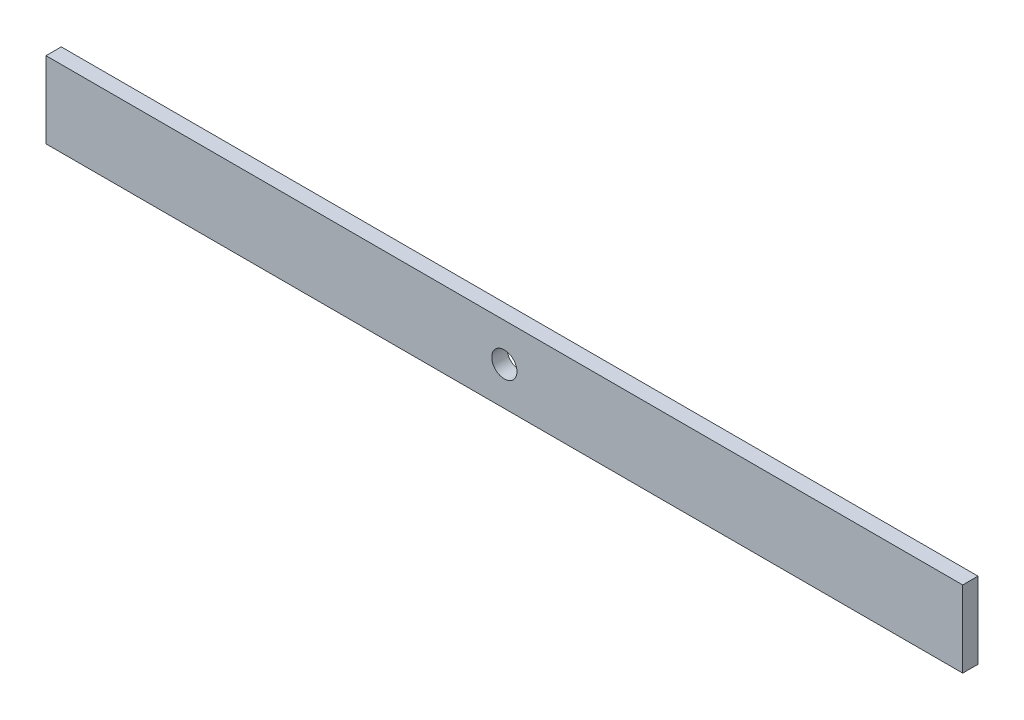
ISO-10303-21;
HEADER;
FILE_DESCRIPTION(('STEP AP214'),'2;1');
FILE_NAME('part.step','',(''),(''),'','','');
FILE_SCHEMA(('AUTOMOTIVE_DESIGN { 1 0 10303 214 1 1 1 1 }'));
ENDSEC;
DATA;
#1=APPLICATION_CONTEXT('core data for automotive mechanical design processes');
#2=APPLICATION_PROTOCOL_DEFINITION('international standard','automotive_design',2000,#1);
#3=PRODUCT_CONTEXT('',#1,'mechanical');
#4=PRODUCT('Part','Part','',(#3));
#5=PRODUCT_RELATED_PRODUCT_CATEGORY('part','',(#4));
#6=PRODUCT_DEFINITION_FORMATION('','',#4);
#7=PRODUCT_DEFINITION_CONTEXT('part definition',#1,'design');
#8=PRODUCT_DEFINITION('design','',#6,#7);
#9=PRODUCT_DEFINITION_SHAPE('','',#8);
#10=(LENGTH_UNIT() NAMED_UNIT(*) SI_UNIT(.MILLI.,.METRE.));
#11=(NAMED_UNIT(*) PLANE_ANGLE_UNIT() SI_UNIT($,.RADIAN.));
#12=(NAMED_UNIT(*) SI_UNIT($,.STERADIAN.) SOLID_ANGLE_UNIT());
#13=UNCERTAINTY_MEASURE_WITH_UNIT(LENGTH_MEASURE(1.E-05),#10,'distance_accuracy_value','');
#14=(GEOMETRIC_REPRESENTATION_CONTEXT(3) GLOBAL_UNCERTAINTY_ASSIGNED_CONTEXT((#13)) GLOBAL_UNIT_ASSIGNED_CONTEXT((#10,
#11,#12)) REPRESENTATION_CONTEXT('',''));
#15=CARTESIAN_POINT('',(0.,0.,0.));
#16=DIRECTION('',(0.,0.,1.));
#17=DIRECTION('',(1.,0.,0.));
#18=AXIS2_PLACEMENT_3D('',#15,#16,#17);
#19=CARTESIAN_POINT('',(60.,5.,-2.));
#20=DIRECTION('',(1.,0.,0.));
#21=DIRECTION('',(0.,0.,-1.));
#22=AXIS2_PLACEMENT_3D('',#19,#20,#21);
#23=PLANE('',#22);
#24=DIRECTION('',(0.,1.,0.));
#25=VECTOR('',#24,1.);
#26=CARTESIAN_POINT('',(60.,5.,0.));
#27=LINE('',#26,#25);
#28=CARTESIAN_POINT('',(60.,-5.,0.));
#29=VERTEX_POINT('',#28);
#30=CARTESIAN_POINT('',(60.,5.,0.));
#31=VERTEX_POINT('',#30);
#32=EDGE_CURVE('E108',#29,#31,#27,.T.);
#33=ORIENTED_EDGE('',*,*,#32,.F.);
#34=DIRECTION('',(0.,0.,1.));
#35=VECTOR('',#34,1.);
#36=CARTESIAN_POINT('',(60.,-5.,-2.));
#37=LINE('',#36,#35);
#38=CARTESIAN_POINT('',(60.,-5.,-2.));
#39=VERTEX_POINT('',#38);
#40=EDGE_CURVE('E11',#39,#29,#37,.T.);
#41=ORIENTED_EDGE('',*,*,#40,.F.);
#42=DIRECTION('',(0.,1.,0.));
#43=VECTOR('',#42,1.);
#44=CARTESIAN_POINT('',(60.,5.,-2.));
#45=LINE('',#44,#43);
#46=CARTESIAN_POINT('',(60.,5.,-2.));
#47=VERTEX_POINT('',#46);
#48=EDGE_CURVE('E101',#39,#47,#45,.T.);
#49=ORIENTED_EDGE('',*,*,#48,.T.);
#50=DIRECTION('',(0.,0.,1.));
#51=VECTOR('',#50,1.);
#52=CARTESIAN_POINT('',(60.,5.,-2.));
#53=LINE('',#52,#51);
#54=EDGE_CURVE('E84',#47,#31,#53,.T.);
#55=ORIENTED_EDGE('',*,*,#54,.T.);
#56=EDGE_LOOP('',(#33,#41,#49,#55));
#57=FACE_BOUND('',#56,.T.);
#58=ADVANCED_FACE('F41',(#57),#23,.T.);
#59=CARTESIAN_POINT('',(-60.,-5.,-2.));
#60=DIRECTION('',(0.,-1.,0.));
#61=DIRECTION('',(0.,0.,-1.));
#62=AXIS2_PLACEMENT_3D('',#59,#60,#61);
#63=PLANE('',#62);
#64=DIRECTION('',(1.,0.,0.));
#65=VECTOR('',#64,1.);
#66=CARTESIAN_POINT('',(-60.,-5.,0.));
#67=LINE('',#66,#65);
#68=CARTESIAN_POINT('',(-60.,-5.,0.));
#69=VERTEX_POINT('',#68);
#70=EDGE_CURVE('E103',#69,#29,#67,.T.);
#71=ORIENTED_EDGE('',*,*,#70,.F.);
#72=DIRECTION('',(0.,0.,1.));
#73=VECTOR('',#72,1.);
#74=CARTESIAN_POINT('',(-60.,-5.,-2.));
#75=LINE('',#74,#73);
#76=CARTESIAN_POINT('',(-60.,-5.,-2.));
#77=VERTEX_POINT('',#76);
#78=EDGE_CURVE('E50',#77,#69,#75,.T.);
#79=ORIENTED_EDGE('',*,*,#78,.F.);
#80=DIRECTION('',(1.,0.,0.));
#81=VECTOR('',#80,1.);
#82=CARTESIAN_POINT('',(-60.,-5.,-2.));
#83=LINE('',#82,#81);
#84=EDGE_CURVE('E98',#77,#39,#83,.T.);
#85=ORIENTED_EDGE('',*,*,#84,.T.);
#86=ORIENTED_EDGE('',*,*,#40,.T.);
#87=EDGE_LOOP('',(#71,#79,#85,#86));
#88=FACE_BOUND('',#87,.T.);
#89=ADVANCED_FACE('F118',(#88),#63,.T.);
#90=CARTESIAN_POINT('',(-60.,5.,-2.));
#91=DIRECTION('',(-1.,0.,0.));
#92=DIRECTION('',(0.,0.,1.));
#93=AXIS2_PLACEMENT_3D('',#90,#91,#92);
#94=PLANE('',#93);
#95=DIRECTION('',(0.,-1.,0.));
#96=VECTOR('',#95,1.);
#97=CARTESIAN_POINT('',(-60.,5.,0.));
#98=LINE('',#97,#96);
#99=CARTESIAN_POINT('',(-60.,5.,0.));
#100=VERTEX_POINT('',#99);
#101=EDGE_CURVE('E92',#100,#69,#98,.T.);
#102=ORIENTED_EDGE('',*,*,#101,.F.);
#103=DIRECTION('',(0.,0.,1.));
#104=VECTOR('',#103,1.);
#105=CARTESIAN_POINT('',(-60.,5.,-2.));
#106=LINE('',#105,#104);
#107=CARTESIAN_POINT('',(-60.,5.,-2.));
#108=VERTEX_POINT('',#107);
#109=EDGE_CURVE('E87',#108,#100,#106,.T.);
#110=ORIENTED_EDGE('',*,*,#109,.F.);
#111=DIRECTION('',(0.,-1.,0.));
#112=VECTOR('',#111,1.);
#113=CARTESIAN_POINT('',(-60.,5.,-2.));
#114=LINE('',#113,#112);
#115=EDGE_CURVE('E90',#108,#77,#114,.T.);
#116=ORIENTED_EDGE('',*,*,#115,.T.);
#117=ORIENTED_EDGE('',*,*,#78,.T.);
#118=EDGE_LOOP('',(#102,#110,#116,#117));
#119=FACE_BOUND('',#118,.T.);
#120=ADVANCED_FACE('F89',(#119),#94,.T.);
#121=CARTESIAN_POINT('',(-60.,5.,-2.));
#122=DIRECTION('',(0.,1.,0.));
#123=DIRECTION('',(0.,0.,1.));
#124=AXIS2_PLACEMENT_3D('',#121,#122,#123);
#125=PLANE('',#124);
#126=DIRECTION('',(-1.,0.,0.));
#127=VECTOR('',#126,1.);
#128=CARTESIAN_POINT('',(-60.,5.,0.));
#129=LINE('',#128,#127);
#130=EDGE_CURVE('E111',#31,#100,#129,.T.);
#131=ORIENTED_EDGE('',*,*,#130,.F.);
#132=ORIENTED_EDGE('',*,*,#54,.F.);
#133=DIRECTION('',(-1.,0.,0.));
#134=VECTOR('',#133,1.);
#135=CARTESIAN_POINT('',(-60.,5.,-2.));
#136=LINE('',#135,#134);
#137=EDGE_CURVE('E97',#47,#108,#136,.T.);
#138=ORIENTED_EDGE('',*,*,#137,.T.);
#139=ORIENTED_EDGE('',*,*,#109,.T.);
#140=EDGE_LOOP('',(#131,#132,#138,#139));
#141=FACE_BOUND('',#140,.T.);
#142=ADVANCED_FACE('F100',(#141),#125,.T.);
#143=CARTESIAN_POINT('',(0.,0.,-2.));
#144=DIRECTION('',(0.,0.,1.));
#145=DIRECTION('',(1.,0.,0.));
#146=AXIS2_PLACEMENT_3D('',#143,#144,#145);
#147=PLANE('',#146);
#148=CARTESIAN_POINT('',(0.,0.,-2.));
#149=DIRECTION('',(0.,0.,-1.));
#150=DIRECTION('',(-1.,0.,0.));
#151=AXIS2_PLACEMENT_3D('',#148,#149,#150);
#152=CIRCLE('',#151,1.65);
#153=CARTESIAN_POINT('',(-1.65,0.,-2.));
#154=VERTEX_POINT('',#153);
#155=EDGE_CURVE('E148',#154,#154,#152,.T.);
#156=ORIENTED_EDGE('',*,*,#155,.F.);
#157=EDGE_LOOP('',(#156));
#158=FACE_BOUND('',#157,.T.);
#159=ORIENTED_EDGE('',*,*,#48,.F.);
#160=ORIENTED_EDGE('',*,*,#84,.F.);
#161=ORIENTED_EDGE('',*,*,#115,.F.);
#162=ORIENTED_EDGE('',*,*,#137,.F.);
#163=EDGE_LOOP('',(#159,#160,#161,#162));
#164=FACE_BOUND('',#163,.T.);
#165=ADVANCED_FACE('F96',(#158,#164),#147,.F.);
#166=CARTESIAN_POINT('',(0.,0.,0.));
#167=DIRECTION('',(0.,0.,1.));
#168=DIRECTION('',(1.,0.,0.));
#169=AXIS2_PLACEMENT_3D('',#166,#167,#168);
#170=PLANE('',#169);
#171=CARTESIAN_POINT('',(0.,0.,0.));
#172=DIRECTION('',(0.,0.,1.));
#173=DIRECTION('',(1.,0.,0.));
#174=AXIS2_PLACEMENT_3D('',#171,#172,#173);
#175=CIRCLE('',#174,1.65);
#176=CARTESIAN_POINT('',(1.65,0.,0.));
#177=VERTEX_POINT('',#176);
#178=EDGE_CURVE('E44',#177,#177,#175,.T.);
#179=ORIENTED_EDGE('',*,*,#178,.F.);
#180=EDGE_LOOP('',(#179));
#181=FACE_BOUND('',#180,.T.);
#182=ORIENTED_EDGE('',*,*,#32,.T.);
#183=ORIENTED_EDGE('',*,*,#130,.T.);
#184=ORIENTED_EDGE('',*,*,#101,.T.);
#185=ORIENTED_EDGE('',*,*,#70,.T.);
#186=EDGE_LOOP('',(#182,#183,#184,#185));
#187=FACE_BOUND('',#186,.T.);
#188=ADVANCED_FACE('F117',(#181,#187),#170,.T.);
#189=CARTESIAN_POINT('',(0.,0.,-2.));
#190=DIRECTION('',(0.,0.,-1.));
#191=DIRECTION('',(-1.,0.,0.));
#192=AXIS2_PLACEMENT_3D('',#189,#190,#191);
#193=CYLINDRICAL_SURFACE('',#192,1.65);
#194=ORIENTED_EDGE('',*,*,#178,.T.);
#195=EDGE_LOOP('',(#194));
#196=FACE_BOUND('',#195,.T.);
#197=ORIENTED_EDGE('',*,*,#155,.T.);
#198=EDGE_LOOP('',(#197));
#199=FACE_BOUND('',#198,.T.);
#200=ADVANCED_FACE('F136',(#196,#199),#193,.F.);
#201=CLOSED_SHELL('',(#58,#89,#120,#142,#165,#188,#200));
#202=MANIFOLD_SOLID_BREP('B2',#201);
#203=ADVANCED_BREP_SHAPE_REPRESENTATION('',(#18,#202),#14);
#204=SHAPE_DEFINITION_REPRESENTATION(#9,#203);
ENDSEC;
END-ISO-10303-21;
